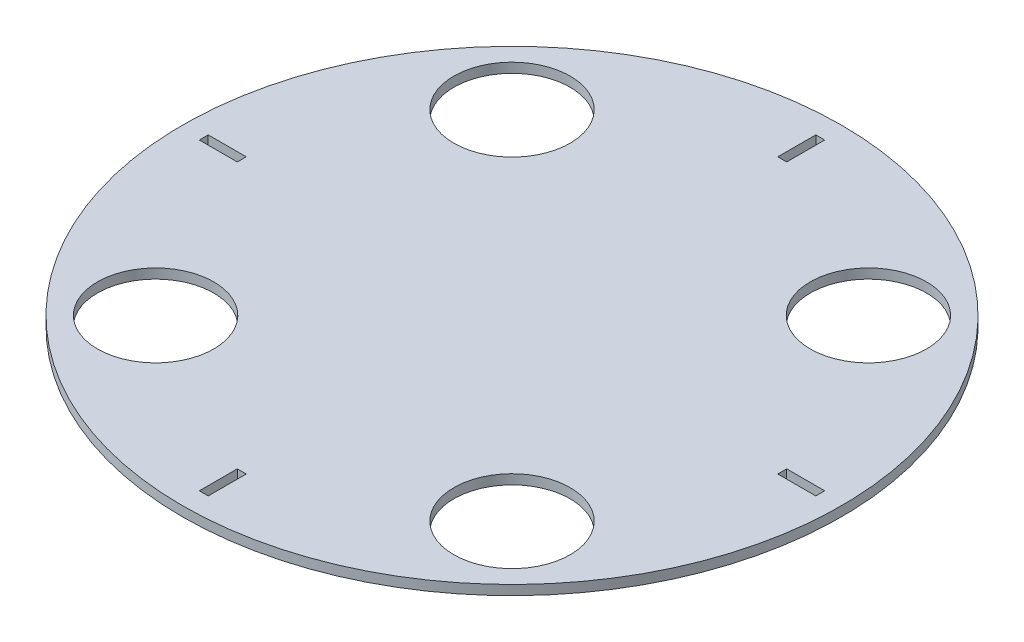
ISO-10303-21;
HEADER;
FILE_DESCRIPTION(('STEP AP214'),'2;1');
FILE_NAME('part.step','',(''),(''),'','','');
FILE_SCHEMA(('AUTOMOTIVE_DESIGN { 1 0 10303 214 1 1 1 1 }'));
ENDSEC;
DATA;
#1=APPLICATION_CONTEXT('core data for automotive mechanical design processes');
#2=APPLICATION_PROTOCOL_DEFINITION('international standard','automotive_design',2000,#1);
#3=PRODUCT_CONTEXT('',#1,'mechanical');
#4=PRODUCT('Part','Part','',(#3));
#5=PRODUCT_RELATED_PRODUCT_CATEGORY('part','',(#4));
#6=PRODUCT_DEFINITION_FORMATION('','',#4);
#7=PRODUCT_DEFINITION_CONTEXT('part definition',#1,'design');
#8=PRODUCT_DEFINITION('design','',#6,#7);
#9=PRODUCT_DEFINITION_SHAPE('','',#8);
#10=(LENGTH_UNIT() NAMED_UNIT(*) SI_UNIT(.MILLI.,.METRE.));
#11=(NAMED_UNIT(*) PLANE_ANGLE_UNIT() SI_UNIT($,.RADIAN.));
#12=(NAMED_UNIT(*) SI_UNIT($,.STERADIAN.) SOLID_ANGLE_UNIT());
#13=UNCERTAINTY_MEASURE_WITH_UNIT(LENGTH_MEASURE(1.E-05),#10,'distance_accuracy_value','');
#14=(GEOMETRIC_REPRESENTATION_CONTEXT(3) GLOBAL_UNCERTAINTY_ASSIGNED_CONTEXT((#13)) GLOBAL_UNIT_ASSIGNED_CONTEXT((#10,
#11,#12)) REPRESENTATION_CONTEXT('',''));
#15=CARTESIAN_POINT('',(0.,0.,0.));
#16=DIRECTION('',(0.,0.,1.));
#17=DIRECTION('',(1.,0.,0.));
#18=AXIS2_PLACEMENT_3D('',#15,#16,#17);
#19=CARTESIAN_POINT('',(0.,-3.175,0.));
#20=DIRECTION('',(0.,1.,0.));
#21=DIRECTION('',(0.,0.,1.));
#22=AXIS2_PLACEMENT_3D('',#19,#20,#21);
#23=CYLINDRICAL_SURFACE('',#22,107.95);
#24=CARTESIAN_POINT('',(0.,-3.175,0.));
#25=DIRECTION('',(0.,1.,0.));
#26=DIRECTION('',(0.,0.,1.));
#27=AXIS2_PLACEMENT_3D('',#24,#25,#26);
#28=CIRCLE('',#27,107.95);
#29=CARTESIAN_POINT('',(0.,-3.175,107.95));
#30=VERTEX_POINT('',#29);
#31=EDGE_CURVE('E11',#30,#30,#28,.T.);
#32=ORIENTED_EDGE('',*,*,#31,.T.);
#33=EDGE_LOOP('',(#32));
#34=FACE_BOUND('',#33,.T.);
#35=CARTESIAN_POINT('',(0.,0.,0.));
#36=DIRECTION('',(0.,1.,0.));
#37=DIRECTION('',(0.,0.,1.));
#38=AXIS2_PLACEMENT_3D('',#35,#36,#37);
#39=CIRCLE('',#38,107.95);
#40=CARTESIAN_POINT('',(0.,0.,107.95));
#41=VERTEX_POINT('',#40);
#42=EDGE_CURVE('E36',#41,#41,#39,.T.);
#43=ORIENTED_EDGE('',*,*,#42,.F.);
#44=EDGE_LOOP('',(#43));
#45=FACE_BOUND('',#44,.T.);
#46=ADVANCED_FACE('F33',(#34,#45),#23,.T.);
#47=CARTESIAN_POINT('',(0.,-3.175,0.));
#48=DIRECTION('',(0.,1.,0.));
#49=DIRECTION('',(0.,0.,1.));
#50=AXIS2_PLACEMENT_3D('',#47,#48,#49);
#51=PLANE('',#50);
#52=DIRECTION('',(0.,0.,-1.));
#53=VECTOR('',#52,1.);
#54=CARTESIAN_POINT('',(1.46050000000106,-3.175,-100.965));
#55=LINE('',#54,#53);
#56=CARTESIAN_POINT('',(1.46050000000093,-3.175,-88.519));
#57=VERTEX_POINT('',#56);
#58=CARTESIAN_POINT('',(1.46050000000106,-3.175,-100.965));
#59=VERTEX_POINT('',#58);
#60=EDGE_CURVE('E153',#57,#59,#55,.T.);
#61=ORIENTED_EDGE('',*,*,#60,.T.);
#62=DIRECTION('',(-1.,0.,0.));
#63=VECTOR('',#62,1.);
#64=CARTESIAN_POINT('',(-1.46049999999894,-3.175,-100.965));
#65=LINE('',#64,#63);
#66=CARTESIAN_POINT('',(-1.46049999999894,-3.175,-100.965));
#67=VERTEX_POINT('',#66);
#68=EDGE_CURVE('E147',#59,#67,#65,.T.);
#69=ORIENTED_EDGE('',*,*,#68,.T.);
#70=DIRECTION('',(0.,0.,1.));
#71=VECTOR('',#70,1.);
#72=CARTESIAN_POINT('',(-1.46049999999894,-3.175,-100.965));
#73=LINE('',#72,#71);
#74=CARTESIAN_POINT('',(-1.46049999999907,-3.175,-88.519));
#75=VERTEX_POINT('',#74);
#76=EDGE_CURVE('E156',#67,#75,#73,.T.);
#77=ORIENTED_EDGE('',*,*,#76,.T.);
#78=DIRECTION('',(1.,0.,0.));
#79=VECTOR('',#78,1.);
#80=CARTESIAN_POINT('',(-1.46049999999907,-3.175,-88.519));
#81=LINE('',#80,#79);
#82=EDGE_CURVE('E47',#75,#57,#81,.T.);
#83=ORIENTED_EDGE('',*,*,#82,.T.);
#84=EDGE_LOOP('',(#61,#69,#77,#83));
#85=FACE_BOUND('',#84,.T.);
#86=DIRECTION('',(-1.,0.,0.));
#87=VECTOR('',#86,1.);
#88=CARTESIAN_POINT('',(-100.965,-3.175,-1.46050000000071));
#89=LINE('',#88,#87);
#90=CARTESIAN_POINT('',(-88.519,-3.175,-1.46050000000062));
#91=VERTEX_POINT('',#90);
#92=CARTESIAN_POINT('',(-100.965,-3.175,-1.46050000000071));
#93=VERTEX_POINT('',#92);
#94=EDGE_CURVE('E192',#91,#93,#89,.T.);
#95=ORIENTED_EDGE('',*,*,#94,.T.);
#96=DIRECTION('',(0.,0.,1.));
#97=VECTOR('',#96,1.);
#98=CARTESIAN_POINT('',(-100.965,-3.175,1.46049999999929));
#99=LINE('',#98,#97);
#100=CARTESIAN_POINT('',(-100.965,-3.175,1.46049999999929));
#101=VERTEX_POINT('',#100);
#102=EDGE_CURVE('E182',#93,#101,#99,.T.);
#103=ORIENTED_EDGE('',*,*,#102,.T.);
#104=DIRECTION('',(1.,0.,0.));
#105=VECTOR('',#104,1.);
#106=CARTESIAN_POINT('',(-100.965,-3.175,1.46049999999929));
#107=LINE('',#106,#105);
#108=CARTESIAN_POINT('',(-88.519,-3.175,1.46049999999938));
#109=VERTEX_POINT('',#108);
#110=EDGE_CURVE('E185',#101,#109,#107,.T.);
#111=ORIENTED_EDGE('',*,*,#110,.T.);
#112=DIRECTION('',(0.,0.,-1.));
#113=VECTOR('',#112,1.);
#114=CARTESIAN_POINT('',(-88.519,-3.175,1.46049999999938));
#115=LINE('',#114,#113);
#116=EDGE_CURVE('E189',#109,#91,#115,.T.);
#117=ORIENTED_EDGE('',*,*,#116,.T.);
#118=EDGE_LOOP('',(#95,#103,#111,#117));
#119=FACE_BOUND('',#118,.T.);
#120=DIRECTION('',(0.,0.,1.));
#121=VECTOR('',#120,1.);
#122=CARTESIAN_POINT('',(-1.46050000000037,-3.175,100.965));
#123=LINE('',#122,#121);
#124=CARTESIAN_POINT('',(-1.46050000000032,-3.175,88.519));
#125=VERTEX_POINT('',#124);
#126=CARTESIAN_POINT('',(-1.46050000000037,-3.175,100.965));
#127=VERTEX_POINT('',#126);
#128=EDGE_CURVE('E224',#125,#127,#123,.T.);
#129=ORIENTED_EDGE('',*,*,#128,.T.);
#130=DIRECTION('',(1.,0.,0.));
#131=VECTOR('',#130,1.);
#132=CARTESIAN_POINT('',(1.46049999999963,-3.175,100.965));
#133=LINE('',#132,#131);
#134=CARTESIAN_POINT('',(1.46049999999963,-3.175,100.965));
#135=VERTEX_POINT('',#134);
#136=EDGE_CURVE('E214',#127,#135,#133,.T.);
#137=ORIENTED_EDGE('',*,*,#136,.T.);
#138=DIRECTION('',(0.,0.,-1.));
#139=VECTOR('',#138,1.);
#140=CARTESIAN_POINT('',(1.46049999999963,-3.175,100.965));
#141=LINE('',#140,#139);
#142=CARTESIAN_POINT('',(1.46049999999968,-3.175,88.519));
#143=VERTEX_POINT('',#142);
#144=EDGE_CURVE('E217',#135,#143,#141,.T.);
#145=ORIENTED_EDGE('',*,*,#144,.T.);
#146=DIRECTION('',(-1.,0.,0.));
#147=VECTOR('',#146,1.);
#148=CARTESIAN_POINT('',(1.46049999999968,-3.175,88.519));
#149=LINE('',#148,#147);
#150=EDGE_CURVE('E221',#143,#125,#149,.T.);
#151=ORIENTED_EDGE('',*,*,#150,.T.);
#152=EDGE_LOOP('',(#129,#137,#145,#151));
#153=FACE_BOUND('',#152,.T.);
#154=CARTESIAN_POINT('',(-58.371664786949,-3.175,-58.37166478695));
#155=DIRECTION('',(0.,1.,0.));
#156=DIRECTION('',(0.,0.,1.));
#157=AXIS2_PLACEMENT_3D('',#154,#155,#156);
#158=CIRCLE('',#157,19.05);
#159=CARTESIAN_POINT('',(-58.371664786949,-3.175,-39.32166478695));
#160=VERTEX_POINT('',#159);
#161=EDGE_CURVE('E246',#160,#160,#158,.T.);
#162=ORIENTED_EDGE('',*,*,#161,.T.);
#163=EDGE_LOOP('',(#162));
#164=FACE_BOUND('',#163,.T.);
#165=CARTESIAN_POINT('',(-58.3716647869498,-3.175,58.3716647869492));
#166=DIRECTION('',(0.,1.,0.));
#167=DIRECTION('',(0.,0.,1.));
#168=AXIS2_PLACEMENT_3D('',#165,#166,#167);
#169=CIRCLE('',#168,19.05);
#170=CARTESIAN_POINT('',(-58.3716647869498,-3.175,77.4216647869492));
#171=VERTEX_POINT('',#170);
#172=EDGE_CURVE('E252',#171,#171,#169,.T.);
#173=ORIENTED_EDGE('',*,*,#172,.T.);
#174=EDGE_LOOP('',(#173));
#175=FACE_BOUND('',#174,.T.);
#176=CARTESIAN_POINT('',(58.3716647869494,-3.175,58.3716647869496));
#177=DIRECTION('',(0.,1.,0.));
#178=DIRECTION('',(0.,0.,1.));
#179=AXIS2_PLACEMENT_3D('',#176,#177,#178);
#180=CIRCLE('',#179,19.05);
#181=CARTESIAN_POINT('',(58.3716647869494,-3.175,77.4216647869496));
#182=VERTEX_POINT('',#181);
#183=EDGE_CURVE('E258',#182,#182,#180,.T.);
#184=ORIENTED_EDGE('',*,*,#183,.T.);
#185=EDGE_LOOP('',(#184));
#186=FACE_BOUND('',#185,.T.);
#187=DIRECTION('',(1.,0.,0.));
#188=VECTOR('',#187,1.);
#189=CARTESIAN_POINT('',(100.965,-3.175,1.4605));
#190=LINE('',#189,#188);
#191=CARTESIAN_POINT('',(88.519,-3.175,1.4605));
#192=VERTEX_POINT('',#191);
#193=CARTESIAN_POINT('',(100.965,-3.175,1.4605));
#194=VERTEX_POINT('',#193);
#195=EDGE_CURVE('E274',#192,#194,#190,.T.);
#196=ORIENTED_EDGE('',*,*,#195,.T.);
#197=DIRECTION('',(0.,0.,-1.));
#198=VECTOR('',#197,1.);
#199=CARTESIAN_POINT('',(100.965,-3.175,-1.4605));
#200=LINE('',#199,#198);
#201=CARTESIAN_POINT('',(100.965,-3.175,-1.4605));
#202=VERTEX_POINT('',#201);
#203=EDGE_CURVE('E264',#194,#202,#200,.T.);
#204=ORIENTED_EDGE('',*,*,#203,.T.);
#205=DIRECTION('',(-1.,0.,0.));
#206=VECTOR('',#205,1.);
#207=CARTESIAN_POINT('',(100.965,-3.175,-1.4605));
#208=LINE('',#207,#206);
#209=CARTESIAN_POINT('',(88.519,-3.175,-1.4605));
#210=VERTEX_POINT('',#209);
#211=EDGE_CURVE('E267',#202,#210,#208,.T.);
#212=ORIENTED_EDGE('',*,*,#211,.T.);
#213=DIRECTION('',(0.,0.,1.));
#214=VECTOR('',#213,1.);
#215=CARTESIAN_POINT('',(88.519,-3.175,-1.4605));
#216=LINE('',#215,#214);
#217=EDGE_CURVE('E271',#210,#192,#216,.T.);
#218=ORIENTED_EDGE('',*,*,#217,.T.);
#219=EDGE_LOOP('',(#196,#204,#212,#218));
#220=FACE_BOUND('',#219,.T.);
#221=CARTESIAN_POINT('',(58.3716647869494,-3.175,-58.3716647869496));
#222=DIRECTION('',(0.,1.,0.));
#223=DIRECTION('',(0.,0.,1.));
#224=AXIS2_PLACEMENT_3D('',#221,#222,#223);
#225=CIRCLE('',#224,19.05);
#226=CARTESIAN_POINT('',(58.3716647869494,-3.175,-39.3216647869496));
#227=VERTEX_POINT('',#226);
#228=EDGE_CURVE('E296',#227,#227,#225,.T.);
#229=ORIENTED_EDGE('',*,*,#228,.T.);
#230=EDGE_LOOP('',(#229));
#231=FACE_BOUND('',#230,.T.);
#232=ORIENTED_EDGE('',*,*,#31,.F.);
#233=EDGE_LOOP('',(#232));
#234=FACE_BOUND('',#233,.T.);
#235=ADVANCED_FACE('F160',(#85,#119,#153,#164,#175,#186,#220,#231,#234),#51,.F.);
#236=CARTESIAN_POINT('',(0.,0.,0.));
#237=DIRECTION('',(0.,1.,0.));
#238=DIRECTION('',(0.,0.,1.));
#239=AXIS2_PLACEMENT_3D('',#236,#237,#238);
#240=PLANE('',#239);
#241=DIRECTION('',(-1.,0.,0.));
#242=VECTOR('',#241,1.);
#243=CARTESIAN_POINT('',(-1.46049999999894,0.,-100.965));
#244=LINE('',#243,#242);
#245=CARTESIAN_POINT('',(1.46050000000106,0.,-100.965));
#246=VERTEX_POINT('',#245);
#247=CARTESIAN_POINT('',(-1.46049999999894,0.,-100.965));
#248=VERTEX_POINT('',#247);
#249=EDGE_CURVE('E55',#246,#248,#244,.T.);
#250=ORIENTED_EDGE('',*,*,#249,.F.);
#251=DIRECTION('',(0.,0.,-1.));
#252=VECTOR('',#251,1.);
#253=CARTESIAN_POINT('',(1.46050000000106,0.,-100.965));
#254=LINE('',#253,#252);
#255=CARTESIAN_POINT('',(1.46050000000093,0.,-88.519));
#256=VERTEX_POINT('',#255);
#257=EDGE_CURVE('E163',#256,#246,#254,.T.);
#258=ORIENTED_EDGE('',*,*,#257,.F.);
#259=DIRECTION('',(1.,0.,0.));
#260=VECTOR('',#259,1.);
#261=CARTESIAN_POINT('',(-1.46049999999907,0.,-88.519));
#262=LINE('',#261,#260);
#263=CARTESIAN_POINT('',(-1.46049999999907,0.,-88.519));
#264=VERTEX_POINT('',#263);
#265=EDGE_CURVE('E166',#264,#256,#262,.T.);
#266=ORIENTED_EDGE('',*,*,#265,.F.);
#267=DIRECTION('',(0.,0.,1.));
#268=VECTOR('',#267,1.);
#269=CARTESIAN_POINT('',(-1.46049999999894,0.,-100.965));
#270=LINE('',#269,#268);
#271=EDGE_CURVE('E172',#248,#264,#270,.T.);
#272=ORIENTED_EDGE('',*,*,#271,.F.);
#273=EDGE_LOOP('',(#250,#258,#266,#272));
#274=FACE_BOUND('',#273,.T.);
#275=DIRECTION('',(0.,0.,1.));
#276=VECTOR('',#275,1.);
#277=CARTESIAN_POINT('',(-100.965,0.,1.46049999999929));
#278=LINE('',#277,#276);
#279=CARTESIAN_POINT('',(-100.965,0.,-1.46050000000071));
#280=VERTEX_POINT('',#279);
#281=CARTESIAN_POINT('',(-100.965,0.,1.46049999999929));
#282=VERTEX_POINT('',#281);
#283=EDGE_CURVE('E178',#280,#282,#278,.T.);
#284=ORIENTED_EDGE('',*,*,#283,.F.);
#285=DIRECTION('',(-1.,0.,0.));
#286=VECTOR('',#285,1.);
#287=CARTESIAN_POINT('',(-100.965,0.,-1.46050000000071));
#288=LINE('',#287,#286);
#289=CARTESIAN_POINT('',(-88.519,0.,-1.46050000000062));
#290=VERTEX_POINT('',#289);
#291=EDGE_CURVE('E186',#290,#280,#288,.T.);
#292=ORIENTED_EDGE('',*,*,#291,.F.);
#293=DIRECTION('',(0.,0.,-1.));
#294=VECTOR('',#293,1.);
#295=CARTESIAN_POINT('',(-88.519,0.,1.46049999999938));
#296=LINE('',#295,#294);
#297=CARTESIAN_POINT('',(-88.519,0.,1.46049999999938));
#298=VERTEX_POINT('',#297);
#299=EDGE_CURVE('E200',#298,#290,#296,.T.);
#300=ORIENTED_EDGE('',*,*,#299,.F.);
#301=DIRECTION('',(1.,0.,0.));
#302=VECTOR('',#301,1.);
#303=CARTESIAN_POINT('',(-100.965,0.,1.46049999999929));
#304=LINE('',#303,#302);
#305=EDGE_CURVE('E197',#282,#298,#304,.T.);
#306=ORIENTED_EDGE('',*,*,#305,.F.);
#307=EDGE_LOOP('',(#284,#292,#300,#306));
#308=FACE_BOUND('',#307,.T.);
#309=DIRECTION('',(1.,0.,0.));
#310=VECTOR('',#309,1.);
#311=CARTESIAN_POINT('',(1.46049999999963,0.,100.965));
#312=LINE('',#311,#310);
#313=CARTESIAN_POINT('',(-1.46050000000037,0.,100.965));
#314=VERTEX_POINT('',#313);
#315=CARTESIAN_POINT('',(1.46049999999963,0.,100.965));
#316=VERTEX_POINT('',#315);
#317=EDGE_CURVE('E207',#314,#316,#312,.T.);
#318=ORIENTED_EDGE('',*,*,#317,.F.);
#319=DIRECTION('',(0.,0.,1.));
#320=VECTOR('',#319,1.);
#321=CARTESIAN_POINT('',(-1.46050000000037,0.,100.965));
#322=LINE('',#321,#320);
#323=CARTESIAN_POINT('',(-1.46050000000032,0.,88.519));
#324=VERTEX_POINT('',#323);
#325=EDGE_CURVE('E218',#324,#314,#322,.T.);
#326=ORIENTED_EDGE('',*,*,#325,.F.);
#327=DIRECTION('',(-1.,0.,0.));
#328=VECTOR('',#327,1.);
#329=CARTESIAN_POINT('',(1.46049999999968,0.,88.519));
#330=LINE('',#329,#328);
#331=CARTESIAN_POINT('',(1.46049999999968,0.,88.519));
#332=VERTEX_POINT('',#331);
#333=EDGE_CURVE('E232',#332,#324,#330,.T.);
#334=ORIENTED_EDGE('',*,*,#333,.F.);
#335=DIRECTION('',(0.,0.,-1.));
#336=VECTOR('',#335,1.);
#337=CARTESIAN_POINT('',(1.46049999999963,0.,100.965));
#338=LINE('',#337,#336);
#339=EDGE_CURVE('E229',#316,#332,#338,.T.);
#340=ORIENTED_EDGE('',*,*,#339,.F.);
#341=EDGE_LOOP('',(#318,#326,#334,#340));
#342=FACE_BOUND('',#341,.T.);
#343=CARTESIAN_POINT('',(-58.371664786949,0.,-58.37166478695));
#344=DIRECTION('',(0.,1.,0.));
#345=DIRECTION('',(0.,0.,1.));
#346=AXIS2_PLACEMENT_3D('',#343,#344,#345);
#347=CIRCLE('',#346,19.05);
#348=CARTESIAN_POINT('',(-58.371664786949,0.,-39.32166478695));
#349=VERTEX_POINT('',#348);
#350=EDGE_CURVE('E239',#349,#349,#347,.T.);
#351=ORIENTED_EDGE('',*,*,#350,.F.);
#352=EDGE_LOOP('',(#351));
#353=FACE_BOUND('',#352,.T.);
#354=CARTESIAN_POINT('',(-58.3716647869498,0.,58.3716647869492));
#355=DIRECTION('',(0.,1.,0.));
#356=DIRECTION('',(0.,0.,1.));
#357=AXIS2_PLACEMENT_3D('',#354,#355,#356);
#358=CIRCLE('',#357,19.05);
#359=CARTESIAN_POINT('',(-58.3716647869498,0.,77.4216647869492));
#360=VERTEX_POINT('',#359);
#361=EDGE_CURVE('E249',#360,#360,#358,.T.);
#362=ORIENTED_EDGE('',*,*,#361,.F.);
#363=EDGE_LOOP('',(#362));
#364=FACE_BOUND('',#363,.T.);
#365=CARTESIAN_POINT('',(58.3716647869494,0.,58.3716647869496));
#366=DIRECTION('',(0.,1.,0.));
#367=DIRECTION('',(0.,0.,1.));
#368=AXIS2_PLACEMENT_3D('',#365,#366,#367);
#369=CIRCLE('',#368,19.05);
#370=CARTESIAN_POINT('',(58.3716647869494,0.,77.4216647869496));
#371=VERTEX_POINT('',#370);
#372=EDGE_CURVE('E255',#371,#371,#369,.T.);
#373=ORIENTED_EDGE('',*,*,#372,.F.);
#374=EDGE_LOOP('',(#373));
#375=FACE_BOUND('',#374,.T.);
#376=DIRECTION('',(0.,0.,-1.));
#377=VECTOR('',#376,1.);
#378=CARTESIAN_POINT('',(100.965,0.,-1.4605));
#379=LINE('',#378,#377);
#380=CARTESIAN_POINT('',(100.965,0.,1.4605));
#381=VERTEX_POINT('',#380);
#382=CARTESIAN_POINT('',(100.965,0.,-1.4605));
#383=VERTEX_POINT('',#382);
#384=EDGE_CURVE('E261',#381,#383,#379,.T.);
#385=ORIENTED_EDGE('',*,*,#384,.F.);
#386=DIRECTION('',(1.,0.,0.));
#387=VECTOR('',#386,1.);
#388=CARTESIAN_POINT('',(100.965,0.,1.4605));
#389=LINE('',#388,#387);
#390=CARTESIAN_POINT('',(88.519,0.,1.4605));
#391=VERTEX_POINT('',#390);
#392=EDGE_CURVE('E268',#391,#381,#389,.T.);
#393=ORIENTED_EDGE('',*,*,#392,.F.);
#394=DIRECTION('',(0.,0.,1.));
#395=VECTOR('',#394,1.);
#396=CARTESIAN_POINT('',(88.519,0.,-1.4605));
#397=LINE('',#396,#395);
#398=CARTESIAN_POINT('',(88.519,0.,-1.4605));
#399=VERTEX_POINT('',#398);
#400=EDGE_CURVE('E282',#399,#391,#397,.T.);
#401=ORIENTED_EDGE('',*,*,#400,.F.);
#402=DIRECTION('',(-1.,0.,0.));
#403=VECTOR('',#402,1.);
#404=CARTESIAN_POINT('',(100.965,0.,-1.4605));
#405=LINE('',#404,#403);
#406=EDGE_CURVE('E279',#383,#399,#405,.T.);
#407=ORIENTED_EDGE('',*,*,#406,.F.);
#408=EDGE_LOOP('',(#385,#393,#401,#407));
#409=FACE_BOUND('',#408,.T.);
#410=CARTESIAN_POINT('',(58.3716647869494,0.,-58.3716647869496));
#411=DIRECTION('',(0.,1.,0.));
#412=DIRECTION('',(0.,0.,1.));
#413=AXIS2_PLACEMENT_3D('',#410,#411,#412);
#414=CIRCLE('',#413,19.05);
#415=CARTESIAN_POINT('',(58.3716647869494,0.,-39.3216647869496));
#416=VERTEX_POINT('',#415);
#417=EDGE_CURVE('E289',#416,#416,#414,.T.);
#418=ORIENTED_EDGE('',*,*,#417,.F.);
#419=EDGE_LOOP('',(#418));
#420=FACE_BOUND('',#419,.T.);
#421=ORIENTED_EDGE('',*,*,#42,.T.);
#422=EDGE_LOOP('',(#421));
#423=FACE_BOUND('',#422,.T.);
#424=ADVANCED_FACE('F304',(#274,#308,#342,#353,#364,#375,#409,#420,#423),#240,.T.);
#425=CARTESIAN_POINT('',(58.3716647869494,-3.175,-58.3716647869496));
#426=DIRECTION('',(0.,1.,0.));
#427=DIRECTION('',(0.,0.,1.));
#428=AXIS2_PLACEMENT_3D('',#425,#426,#427);
#429=CYLINDRICAL_SURFACE('',#428,19.05);
#430=ORIENTED_EDGE('',*,*,#228,.F.);
#431=EDGE_LOOP('',(#430));
#432=FACE_BOUND('',#431,.T.);
#433=ORIENTED_EDGE('',*,*,#417,.T.);
#434=EDGE_LOOP('',(#433));
#435=FACE_BOUND('',#434,.T.);
#436=ADVANCED_FACE('F302',(#432,#435),#429,.F.);
#437=CARTESIAN_POINT('',(100.965,-3.175,-1.4605));
#438=DIRECTION('',(1.,0.,0.));
#439=DIRECTION('',(0.,0.,-1.));
#440=AXIS2_PLACEMENT_3D('',#437,#438,#439);
#441=PLANE('',#440);
#442=ORIENTED_EDGE('',*,*,#384,.T.);
#443=DIRECTION('',(0.,1.,0.));
#444=VECTOR('',#443,1.);
#445=CARTESIAN_POINT('',(100.965,-3.175,-1.4605));
#446=LINE('',#445,#444);
#447=EDGE_CURVE('E277',#202,#383,#446,.T.);
#448=ORIENTED_EDGE('',*,*,#447,.F.);
#449=ORIENTED_EDGE('',*,*,#203,.F.);
#450=DIRECTION('',(0.,1.,0.));
#451=VECTOR('',#450,1.);
#452=CARTESIAN_POINT('',(100.965,-3.175,1.4605));
#453=LINE('',#452,#451);
#454=EDGE_CURVE('E287',#194,#381,#453,.T.);
#455=ORIENTED_EDGE('',*,*,#454,.T.);
#456=EDGE_LOOP('',(#442,#448,#449,#455));
#457=FACE_BOUND('',#456,.T.);
#458=ADVANCED_FACE('F324',(#457),#441,.F.);
#459=CARTESIAN_POINT('',(100.965,-3.175,1.4605));
#460=DIRECTION('',(0.,0.,1.));
#461=DIRECTION('',(1.,0.,0.));
#462=AXIS2_PLACEMENT_3D('',#459,#460,#461);
#463=PLANE('',#462);
#464=ORIENTED_EDGE('',*,*,#392,.T.);
#465=ORIENTED_EDGE('',*,*,#454,.F.);
#466=ORIENTED_EDGE('',*,*,#195,.F.);
#467=DIRECTION('',(0.,1.,0.));
#468=VECTOR('',#467,1.);
#469=CARTESIAN_POINT('',(88.519,-3.175,1.4605));
#470=LINE('',#469,#468);
#471=EDGE_CURVE('E290',#192,#391,#470,.T.);
#472=ORIENTED_EDGE('',*,*,#471,.T.);
#473=EDGE_LOOP('',(#464,#465,#466,#472));
#474=FACE_BOUND('',#473,.T.);
#475=ADVANCED_FACE('F328',(#474),#463,.F.);
#476=CARTESIAN_POINT('',(88.519,-3.175,-1.4605));
#477=DIRECTION('',(-1.,0.,0.));
#478=DIRECTION('',(0.,0.,1.));
#479=AXIS2_PLACEMENT_3D('',#476,#477,#478);
#480=PLANE('',#479);
#481=ORIENTED_EDGE('',*,*,#400,.T.);
#482=ORIENTED_EDGE('',*,*,#471,.F.);
#483=ORIENTED_EDGE('',*,*,#217,.F.);
#484=DIRECTION('',(0.,1.,0.));
#485=VECTOR('',#484,1.);
#486=CARTESIAN_POINT('',(88.519,-3.175,-1.4605));
#487=LINE('',#486,#485);
#488=EDGE_CURVE('E292',#210,#399,#487,.T.);
#489=ORIENTED_EDGE('',*,*,#488,.T.);
#490=EDGE_LOOP('',(#481,#482,#483,#489));
#491=FACE_BOUND('',#490,.T.);
#492=ADVANCED_FACE('F334',(#491),#480,.F.);
#493=CARTESIAN_POINT('',(100.965,-3.175,-1.4605));
#494=DIRECTION('',(0.,0.,-1.));
#495=DIRECTION('',(-1.,0.,0.));
#496=AXIS2_PLACEMENT_3D('',#493,#494,#495);
#497=PLANE('',#496);
#498=ORIENTED_EDGE('',*,*,#406,.T.);
#499=ORIENTED_EDGE('',*,*,#488,.F.);
#500=ORIENTED_EDGE('',*,*,#211,.F.);
#501=ORIENTED_EDGE('',*,*,#447,.T.);
#502=EDGE_LOOP('',(#498,#499,#500,#501));
#503=FACE_BOUND('',#502,.T.);
#504=ADVANCED_FACE('F330',(#503),#497,.F.);
#505=CARTESIAN_POINT('',(58.3716647869494,-3.175,58.3716647869496));
#506=DIRECTION('',(0.,1.,0.));
#507=DIRECTION('',(0.,0.,1.));
#508=AXIS2_PLACEMENT_3D('',#505,#506,#507);
#509=CYLINDRICAL_SURFACE('',#508,19.05);
#510=ORIENTED_EDGE('',*,*,#183,.F.);
#511=EDGE_LOOP('',(#510));
#512=FACE_BOUND('',#511,.T.);
#513=ORIENTED_EDGE('',*,*,#372,.T.);
#514=EDGE_LOOP('',(#513));
#515=FACE_BOUND('',#514,.T.);
#516=ADVANCED_FACE('F333',(#512,#515),#509,.F.);
#517=CARTESIAN_POINT('',(-58.3716647869498,-3.175,58.3716647869492));
#518=DIRECTION('',(0.,1.,0.));
#519=DIRECTION('',(0.,0.,1.));
#520=AXIS2_PLACEMENT_3D('',#517,#518,#519);
#521=CYLINDRICAL_SURFACE('',#520,19.05);
#522=ORIENTED_EDGE('',*,*,#172,.F.);
#523=EDGE_LOOP('',(#522));
#524=FACE_BOUND('',#523,.T.);
#525=ORIENTED_EDGE('',*,*,#361,.T.);
#526=EDGE_LOOP('',(#525));
#527=FACE_BOUND('',#526,.T.);
#528=ADVANCED_FACE('F344',(#524,#527),#521,.F.);
#529=CARTESIAN_POINT('',(-58.371664786949,-3.175,-58.37166478695));
#530=DIRECTION('',(0.,1.,0.));
#531=DIRECTION('',(0.,0.,1.));
#532=AXIS2_PLACEMENT_3D('',#529,#530,#531);
#533=CYLINDRICAL_SURFACE('',#532,19.05);
#534=ORIENTED_EDGE('',*,*,#161,.F.);
#535=EDGE_LOOP('',(#534));
#536=FACE_BOUND('',#535,.T.);
#537=ORIENTED_EDGE('',*,*,#350,.T.);
#538=EDGE_LOOP('',(#537));
#539=FACE_BOUND('',#538,.T.);
#540=ADVANCED_FACE('F348',(#536,#539),#533,.F.);
#541=CARTESIAN_POINT('',(1.46049999999963,-3.175,100.965));
#542=DIRECTION('',(0.,0.,1.));
#543=DIRECTION('',(1.,0.,0.));
#544=AXIS2_PLACEMENT_3D('',#541,#542,#543);
#545=PLANE('',#544);
#546=ORIENTED_EDGE('',*,*,#317,.T.);
#547=DIRECTION('',(0.,1.,0.));
#548=VECTOR('',#547,1.);
#549=CARTESIAN_POINT('',(1.46049999999963,-3.175,100.965));
#550=LINE('',#549,#548);
#551=EDGE_CURVE('E227',#135,#316,#550,.T.);
#552=ORIENTED_EDGE('',*,*,#551,.F.);
#553=ORIENTED_EDGE('',*,*,#136,.F.);
#554=DIRECTION('',(0.,1.,0.));
#555=VECTOR('',#554,1.);
#556=CARTESIAN_POINT('',(-1.46050000000037,-3.175,100.965));
#557=LINE('',#556,#555);
#558=EDGE_CURVE('E237',#127,#314,#557,.T.);
#559=ORIENTED_EDGE('',*,*,#558,.T.);
#560=EDGE_LOOP('',(#546,#552,#553,#559));
#561=FACE_BOUND('',#560,.T.);
#562=ADVANCED_FACE('F352',(#561),#545,.F.);
#563=CARTESIAN_POINT('',(-1.46050000000037,-3.175,100.965));
#564=DIRECTION('',(-1.,0.,0.));
#565=DIRECTION('',(0.,0.,1.));
#566=AXIS2_PLACEMENT_3D('',#563,#564,#565);
#567=PLANE('',#566);
#568=ORIENTED_EDGE('',*,*,#325,.T.);
#569=ORIENTED_EDGE('',*,*,#558,.F.);
#570=ORIENTED_EDGE('',*,*,#128,.F.);
#571=DIRECTION('',(0.,1.,0.));
#572=VECTOR('',#571,1.);
#573=CARTESIAN_POINT('',(-1.46050000000032,-3.175,88.519));
#574=LINE('',#573,#572);
#575=EDGE_CURVE('E240',#125,#324,#574,.T.);
#576=ORIENTED_EDGE('',*,*,#575,.T.);
#577=EDGE_LOOP('',(#568,#569,#570,#576));
#578=FACE_BOUND('',#577,.T.);
#579=ADVANCED_FACE('F356',(#578),#567,.F.);
#580=CARTESIAN_POINT('',(1.46049999999968,-3.175,88.519));
#581=DIRECTION('',(0.,0.,-1.));
#582=DIRECTION('',(-1.,0.,0.));
#583=AXIS2_PLACEMENT_3D('',#580,#581,#582);
#584=PLANE('',#583);
#585=ORIENTED_EDGE('',*,*,#333,.T.);
#586=ORIENTED_EDGE('',*,*,#575,.F.);
#587=ORIENTED_EDGE('',*,*,#150,.F.);
#588=DIRECTION('',(0.,1.,0.));
#589=VECTOR('',#588,1.);
#590=CARTESIAN_POINT('',(1.46049999999968,-3.175,88.519));
#591=LINE('',#590,#589);
#592=EDGE_CURVE('E242',#143,#332,#591,.T.);
#593=ORIENTED_EDGE('',*,*,#592,.T.);
#594=EDGE_LOOP('',(#585,#586,#587,#593));
#595=FACE_BOUND('',#594,.T.);
#596=ADVANCED_FACE('F362',(#595),#584,.F.);
#597=CARTESIAN_POINT('',(1.46049999999963,-3.175,100.965));
#598=DIRECTION('',(1.,0.,0.));
#599=DIRECTION('',(0.,0.,-1.));
#600=AXIS2_PLACEMENT_3D('',#597,#598,#599);
#601=PLANE('',#600);
#602=ORIENTED_EDGE('',*,*,#339,.T.);
#603=ORIENTED_EDGE('',*,*,#592,.F.);
#604=ORIENTED_EDGE('',*,*,#144,.F.);
#605=ORIENTED_EDGE('',*,*,#551,.T.);
#606=EDGE_LOOP('',(#602,#603,#604,#605));
#607=FACE_BOUND('',#606,.T.);
#608=ADVANCED_FACE('F358',(#607),#601,.F.);
#609=CARTESIAN_POINT('',(-100.965,-3.175,1.46049999999929));
#610=DIRECTION('',(-1.,0.,0.));
#611=DIRECTION('',(0.,0.,1.));
#612=AXIS2_PLACEMENT_3D('',#609,#610,#611);
#613=PLANE('',#612);
#614=ORIENTED_EDGE('',*,*,#283,.T.);
#615=DIRECTION('',(0.,1.,0.));
#616=VECTOR('',#615,1.);
#617=CARTESIAN_POINT('',(-100.965,-3.175,1.46049999999929));
#618=LINE('',#617,#616);
#619=EDGE_CURVE('E195',#101,#282,#618,.T.);
#620=ORIENTED_EDGE('',*,*,#619,.F.);
#621=ORIENTED_EDGE('',*,*,#102,.F.);
#622=DIRECTION('',(0.,1.,0.));
#623=VECTOR('',#622,1.);
#624=CARTESIAN_POINT('',(-100.965,-3.175,-1.46050000000071));
#625=LINE('',#624,#623);
#626=EDGE_CURVE('E205',#93,#280,#625,.T.);
#627=ORIENTED_EDGE('',*,*,#626,.T.);
#628=EDGE_LOOP('',(#614,#620,#621,#627));
#629=FACE_BOUND('',#628,.T.);
#630=ADVANCED_FACE('F361',(#629),#613,.F.);
#631=CARTESIAN_POINT('',(-100.965,-3.175,-1.46050000000071));
#632=DIRECTION('',(0.,0.,-1.));
#633=DIRECTION('',(-1.,0.,0.));
#634=AXIS2_PLACEMENT_3D('',#631,#632,#633);
#635=PLANE('',#634);
#636=ORIENTED_EDGE('',*,*,#291,.T.);
#637=ORIENTED_EDGE('',*,*,#626,.F.);
#638=ORIENTED_EDGE('',*,*,#94,.F.);
#639=DIRECTION('',(0.,1.,0.));
#640=VECTOR('',#639,1.);
#641=CARTESIAN_POINT('',(-88.519,-3.175,-1.46050000000062));
#642=LINE('',#641,#640);
#643=EDGE_CURVE('E208',#91,#290,#642,.T.);
#644=ORIENTED_EDGE('',*,*,#643,.T.);
#645=EDGE_LOOP('',(#636,#637,#638,#644));
#646=FACE_BOUND('',#645,.T.);
#647=ADVANCED_FACE('F372',(#646),#635,.F.);
#648=CARTESIAN_POINT('',(-88.519,-3.175,1.46049999999938));
#649=DIRECTION('',(1.,0.,0.));
#650=DIRECTION('',(0.,0.,-1.));
#651=AXIS2_PLACEMENT_3D('',#648,#649,#650);
#652=PLANE('',#651);
#653=ORIENTED_EDGE('',*,*,#299,.T.);
#654=ORIENTED_EDGE('',*,*,#643,.F.);
#655=ORIENTED_EDGE('',*,*,#116,.F.);
#656=DIRECTION('',(0.,1.,0.));
#657=VECTOR('',#656,1.);
#658=CARTESIAN_POINT('',(-88.519,-3.175,1.46049999999938));
#659=LINE('',#658,#657);
#660=EDGE_CURVE('E210',#109,#298,#659,.T.);
#661=ORIENTED_EDGE('',*,*,#660,.T.);
#662=EDGE_LOOP('',(#653,#654,#655,#661));
#663=FACE_BOUND('',#662,.T.);
#664=ADVANCED_FACE('F377',(#663),#652,.F.);
#665=CARTESIAN_POINT('',(-100.965,-3.175,1.46049999999929));
#666=DIRECTION('',(0.,0.,1.));
#667=DIRECTION('',(1.,0.,0.));
#668=AXIS2_PLACEMENT_3D('',#665,#666,#667);
#669=PLANE('',#668);
#670=ORIENTED_EDGE('',*,*,#305,.T.);
#671=ORIENTED_EDGE('',*,*,#660,.F.);
#672=ORIENTED_EDGE('',*,*,#110,.F.);
#673=ORIENTED_EDGE('',*,*,#619,.T.);
#674=EDGE_LOOP('',(#670,#671,#672,#673));
#675=FACE_BOUND('',#674,.T.);
#676=ADVANCED_FACE('F374',(#675),#669,.F.);
#677=CARTESIAN_POINT('',(-1.46049999999894,-3.175,-100.965));
#678=DIRECTION('',(0.,0.,-1.));
#679=DIRECTION('',(-1.,0.,0.));
#680=AXIS2_PLACEMENT_3D('',#677,#678,#679);
#681=PLANE('',#680);
#682=ORIENTED_EDGE('',*,*,#249,.T.);
#683=DIRECTION('',(0.,1.,0.));
#684=VECTOR('',#683,1.);
#685=CARTESIAN_POINT('',(-1.46049999999894,-3.175,-100.965));
#686=LINE('',#685,#684);
#687=EDGE_CURVE('E143',#67,#248,#686,.T.);
#688=ORIENTED_EDGE('',*,*,#687,.F.);
#689=ORIENTED_EDGE('',*,*,#68,.F.);
#690=DIRECTION('',(0.,1.,0.));
#691=VECTOR('',#690,1.);
#692=CARTESIAN_POINT('',(1.46050000000106,-3.175,-100.965));
#693=LINE('',#692,#691);
#694=EDGE_CURVE('E176',#59,#246,#693,.T.);
#695=ORIENTED_EDGE('',*,*,#694,.T.);
#696=EDGE_LOOP('',(#682,#688,#689,#695));
#697=FACE_BOUND('',#696,.T.);
#698=ADVANCED_FACE('F145',(#697),#681,.F.);
#699=CARTESIAN_POINT('',(1.46050000000106,-3.175,-100.965));
#700=DIRECTION('',(1.,0.,0.));
#701=DIRECTION('',(0.,0.,-1.));
#702=AXIS2_PLACEMENT_3D('',#699,#700,#701);
#703=PLANE('',#702);
#704=ORIENTED_EDGE('',*,*,#257,.T.);
#705=ORIENTED_EDGE('',*,*,#694,.F.);
#706=ORIENTED_EDGE('',*,*,#60,.F.);
#707=DIRECTION('',(0.,1.,0.));
#708=VECTOR('',#707,1.);
#709=CARTESIAN_POINT('',(1.46050000000093,-3.175,-88.519));
#710=LINE('',#709,#708);
#711=EDGE_CURVE('E179',#57,#256,#710,.T.);
#712=ORIENTED_EDGE('',*,*,#711,.T.);
#713=EDGE_LOOP('',(#704,#705,#706,#712));
#714=FACE_BOUND('',#713,.T.);
#715=ADVANCED_FACE('F387',(#714),#703,.F.);
#716=CARTESIAN_POINT('',(-1.46049999999907,-3.175,-88.519));
#717=DIRECTION('',(0.,0.,1.));
#718=DIRECTION('',(1.,0.,0.));
#719=AXIS2_PLACEMENT_3D('',#716,#717,#718);
#720=PLANE('',#719);
#721=ORIENTED_EDGE('',*,*,#265,.T.);
#722=ORIENTED_EDGE('',*,*,#711,.F.);
#723=ORIENTED_EDGE('',*,*,#82,.F.);
#724=DIRECTION('',(0.,1.,0.));
#725=VECTOR('',#724,1.);
#726=CARTESIAN_POINT('',(-1.46049999999907,-3.175,-88.519));
#727=LINE('',#726,#725);
#728=EDGE_CURVE('E152',#75,#264,#727,.T.);
#729=ORIENTED_EDGE('',*,*,#728,.T.);
#730=EDGE_LOOP('',(#721,#722,#723,#729));
#731=FACE_BOUND('',#730,.T.);
#732=ADVANCED_FACE('F390',(#731),#720,.F.);
#733=CARTESIAN_POINT('',(-1.46049999999894,-3.175,-100.965));
#734=DIRECTION('',(-1.,0.,0.));
#735=DIRECTION('',(0.,0.,1.));
#736=AXIS2_PLACEMENT_3D('',#733,#734,#735);
#737=PLANE('',#736);
#738=ORIENTED_EDGE('',*,*,#271,.T.);
#739=ORIENTED_EDGE('',*,*,#728,.F.);
#740=ORIENTED_EDGE('',*,*,#76,.F.);
#741=ORIENTED_EDGE('',*,*,#687,.T.);
#742=EDGE_LOOP('',(#738,#739,#740,#741));
#743=FACE_BOUND('',#742,.T.);
#744=ADVANCED_FACE('F157',(#743),#737,.F.);
#745=CLOSED_SHELL('',(#46,#235,#424,#436,#458,#475,#492,#504,#516,#528,#540,#562,#579,#596,#608,
#630,#647,#664,#676,#698,#715,#732,#744));
#746=MANIFOLD_SOLID_BREP('B2',#745);
#747=ADVANCED_BREP_SHAPE_REPRESENTATION('',(#18,#746),#14);
#748=SHAPE_DEFINITION_REPRESENTATION(#9,#747);
ENDSEC;
END-ISO-10303-21;
